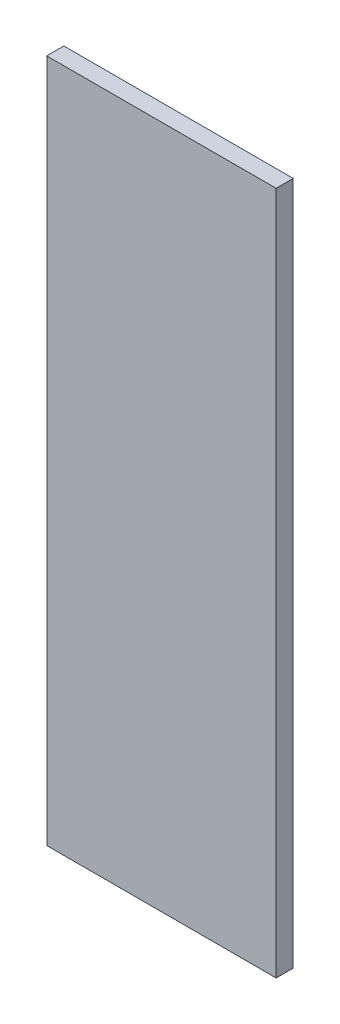
ISO-10303-21;
HEADER;
FILE_DESCRIPTION(('STEP AP214'),'2;1');
FILE_NAME('part.step','',(''),(''),'','','');
FILE_SCHEMA(('AUTOMOTIVE_DESIGN { 1 0 10303 214 1 1 1 1 }'));
ENDSEC;
DATA;
#1=APPLICATION_CONTEXT('core data for automotive mechanical design processes');
#2=APPLICATION_PROTOCOL_DEFINITION('international standard','automotive_design',2000,#1);
#3=PRODUCT_CONTEXT('',#1,'mechanical');
#4=PRODUCT('Part','Part','',(#3));
#5=PRODUCT_RELATED_PRODUCT_CATEGORY('part','',(#4));
#6=PRODUCT_DEFINITION_FORMATION('','',#4);
#7=PRODUCT_DEFINITION_CONTEXT('part definition',#1,'design');
#8=PRODUCT_DEFINITION('design','',#6,#7);
#9=PRODUCT_DEFINITION_SHAPE('','',#8);
#10=(LENGTH_UNIT() NAMED_UNIT(*) SI_UNIT(.MILLI.,.METRE.));
#11=(NAMED_UNIT(*) PLANE_ANGLE_UNIT() SI_UNIT($,.RADIAN.));
#12=(NAMED_UNIT(*) SI_UNIT($,.STERADIAN.) SOLID_ANGLE_UNIT());
#13=UNCERTAINTY_MEASURE_WITH_UNIT(LENGTH_MEASURE(1.E-05),#10,'distance_accuracy_value','');
#14=(GEOMETRIC_REPRESENTATION_CONTEXT(3) GLOBAL_UNCERTAINTY_ASSIGNED_CONTEXT((#13)) GLOBAL_UNIT_ASSIGNED_CONTEXT((#10,
#11,#12)) REPRESENTATION_CONTEXT('',''));
#15=CARTESIAN_POINT('',(0.,0.,0.));
#16=DIRECTION('',(0.,0.,1.));
#17=DIRECTION('',(1.,0.,0.));
#18=AXIS2_PLACEMENT_3D('',#15,#16,#17);
#19=CARTESIAN_POINT('',(21.298547485,-63.5,3.175));
#20=DIRECTION('',(-1.,0.,0.));
#21=DIRECTION('',(0.,0.,1.));
#22=AXIS2_PLACEMENT_3D('',#19,#20,#21);
#23=PLANE('',#22);
#24=DIRECTION('',(0.,1.,0.));
#25=VECTOR('',#24,1.);
#26=CARTESIAN_POINT('',(21.298547485,-63.5,0.));
#27=LINE('',#26,#25);
#28=CARTESIAN_POINT('',(21.298547485,-63.5,0.));
#29=VERTEX_POINT('',#28);
#30=CARTESIAN_POINT('',(21.298547485,63.5,0.));
#31=VERTEX_POINT('',#30);
#32=EDGE_CURVE('E107',#29,#31,#27,.T.);
#33=ORIENTED_EDGE('',*,*,#32,.T.);
#34=DIRECTION('',(0.,0.,-1.));
#35=VECTOR('',#34,1.);
#36=CARTESIAN_POINT('',(21.298547485,63.5,3.175));
#37=LINE('',#36,#35);
#38=CARTESIAN_POINT('',(21.298547485,63.5,3.175));
#39=VERTEX_POINT('',#38);
#40=EDGE_CURVE('E11',#39,#31,#37,.T.);
#41=ORIENTED_EDGE('',*,*,#40,.F.);
#42=DIRECTION('',(0.,1.,0.));
#43=VECTOR('',#42,1.);
#44=CARTESIAN_POINT('',(21.298547485,-63.5,3.175));
#45=LINE('',#44,#43);
#46=CARTESIAN_POINT('',(21.298547485,-63.5,3.175));
#47=VERTEX_POINT('',#46);
#48=EDGE_CURVE('E91',#47,#39,#45,.T.);
#49=ORIENTED_EDGE('',*,*,#48,.F.);
#50=DIRECTION('',(0.,0.,-1.));
#51=VECTOR('',#50,1.);
#52=CARTESIAN_POINT('',(21.298547485,-63.5,3.175));
#53=LINE('',#52,#51);
#54=EDGE_CURVE('E103',#47,#29,#53,.T.);
#55=ORIENTED_EDGE('',*,*,#54,.T.);
#56=EDGE_LOOP('',(#33,#41,#49,#55));
#57=FACE_BOUND('',#56,.T.);
#58=ADVANCED_FACE('F39',(#57),#23,.F.);
#59=CARTESIAN_POINT('',(-21.298547485,63.5,3.175));
#60=DIRECTION('',(0.,-1.,0.));
#61=DIRECTION('',(0.,0.,-1.));
#62=AXIS2_PLACEMENT_3D('',#59,#60,#61);
#63=PLANE('',#62);
#64=DIRECTION('',(-1.,0.,0.));
#65=VECTOR('',#64,1.);
#66=CARTESIAN_POINT('',(-21.298547485,63.5,0.));
#67=LINE('',#66,#65);
#68=CARTESIAN_POINT('',(-21.298547485,63.5,0.));
#69=VERTEX_POINT('',#68);
#70=EDGE_CURVE('E96',#31,#69,#67,.T.);
#71=ORIENTED_EDGE('',*,*,#70,.T.);
#72=DIRECTION('',(0.,0.,-1.));
#73=VECTOR('',#72,1.);
#74=CARTESIAN_POINT('',(-21.298547485,63.5,3.175));
#75=LINE('',#74,#73);
#76=CARTESIAN_POINT('',(-21.298547485,63.5,3.175));
#77=VERTEX_POINT('',#76);
#78=EDGE_CURVE('E48',#77,#69,#75,.T.);
#79=ORIENTED_EDGE('',*,*,#78,.F.);
#80=DIRECTION('',(-1.,0.,0.));
#81=VECTOR('',#80,1.);
#82=CARTESIAN_POINT('',(-21.298547485,63.5,3.175));
#83=LINE('',#82,#81);
#84=EDGE_CURVE('E86',#39,#77,#83,.T.);
#85=ORIENTED_EDGE('',*,*,#84,.F.);
#86=ORIENTED_EDGE('',*,*,#40,.T.);
#87=EDGE_LOOP('',(#71,#79,#85,#86));
#88=FACE_BOUND('',#87,.T.);
#89=ADVANCED_FACE('F95',(#88),#63,.F.);
#90=CARTESIAN_POINT('',(-21.298547485,-63.5,3.175));
#91=DIRECTION('',(1.,0.,0.));
#92=DIRECTION('',(0.,0.,-1.));
#93=AXIS2_PLACEMENT_3D('',#90,#91,#92);
#94=PLANE('',#93);
#95=DIRECTION('',(0.,-1.,0.));
#96=VECTOR('',#95,1.);
#97=CARTESIAN_POINT('',(-21.298547485,-63.5,0.));
#98=LINE('',#97,#96);
#99=CARTESIAN_POINT('',(-21.298547485,-63.5,0.));
#100=VERTEX_POINT('',#99);
#101=EDGE_CURVE('E73',#69,#100,#98,.T.);
#102=ORIENTED_EDGE('',*,*,#101,.T.);
#103=DIRECTION('',(0.,0.,-1.));
#104=VECTOR('',#103,1.);
#105=CARTESIAN_POINT('',(-21.298547485,-63.5,3.175));
#106=LINE('',#105,#104);
#107=CARTESIAN_POINT('',(-21.298547485,-63.5,3.175));
#108=VERTEX_POINT('',#107);
#109=EDGE_CURVE('E98',#108,#100,#106,.T.);
#110=ORIENTED_EDGE('',*,*,#109,.F.);
#111=DIRECTION('',(0.,-1.,0.));
#112=VECTOR('',#111,1.);
#113=CARTESIAN_POINT('',(-21.298547485,-63.5,3.175));
#114=LINE('',#113,#112);
#115=EDGE_CURVE('E89',#77,#108,#114,.T.);
#116=ORIENTED_EDGE('',*,*,#115,.F.);
#117=ORIENTED_EDGE('',*,*,#78,.T.);
#118=EDGE_LOOP('',(#102,#110,#116,#117));
#119=FACE_BOUND('',#118,.T.);
#120=ADVANCED_FACE('F99',(#119),#94,.F.);
#121=CARTESIAN_POINT('',(-21.298547485,-63.5,3.175));
#122=DIRECTION('',(0.,1.,0.));
#123=DIRECTION('',(0.,0.,1.));
#124=AXIS2_PLACEMENT_3D('',#121,#122,#123);
#125=PLANE('',#124);
#126=DIRECTION('',(1.,0.,0.));
#127=VECTOR('',#126,1.);
#128=CARTESIAN_POINT('',(-21.298547485,-63.5,0.));
#129=LINE('',#128,#127);
#130=EDGE_CURVE('E79',#100,#29,#129,.T.);
#131=ORIENTED_EDGE('',*,*,#130,.T.);
#132=ORIENTED_EDGE('',*,*,#54,.F.);
#133=DIRECTION('',(1.,0.,0.));
#134=VECTOR('',#133,1.);
#135=CARTESIAN_POINT('',(-21.298547485,-63.5,3.175));
#136=LINE('',#135,#134);
#137=EDGE_CURVE('E56',#108,#47,#136,.T.);
#138=ORIENTED_EDGE('',*,*,#137,.F.);
#139=ORIENTED_EDGE('',*,*,#109,.T.);
#140=EDGE_LOOP('',(#131,#132,#138,#139));
#141=FACE_BOUND('',#140,.T.);
#142=ADVANCED_FACE('F120',(#141),#125,.F.);
#143=CARTESIAN_POINT('',(0.,0.,3.175));
#144=DIRECTION('',(0.,0.,-1.));
#145=DIRECTION('',(-1.,0.,0.));
#146=AXIS2_PLACEMENT_3D('',#143,#144,#145);
#147=PLANE('',#146);
#148=ORIENTED_EDGE('',*,*,#48,.T.);
#149=ORIENTED_EDGE('',*,*,#84,.T.);
#150=ORIENTED_EDGE('',*,*,#115,.T.);
#151=ORIENTED_EDGE('',*,*,#137,.T.);
#152=EDGE_LOOP('',(#148,#149,#150,#151));
#153=FACE_BOUND('',#152,.T.);
#154=ADVANCED_FACE('F87',(#153),#147,.F.);
#155=CARTESIAN_POINT('',(0.,0.,0.));
#156=DIRECTION('',(0.,0.,-1.));
#157=DIRECTION('',(-1.,0.,0.));
#158=AXIS2_PLACEMENT_3D('',#155,#156,#157);
#159=PLANE('',#158);
#160=ORIENTED_EDGE('',*,*,#32,.F.);
#161=ORIENTED_EDGE('',*,*,#130,.F.);
#162=ORIENTED_EDGE('',*,*,#101,.F.);
#163=ORIENTED_EDGE('',*,*,#70,.F.);
#164=EDGE_LOOP('',(#160,#161,#162,#163));
#165=FACE_BOUND('',#164,.T.);
#166=ADVANCED_FACE('F123',(#165),#159,.T.);
#167=CLOSED_SHELL('',(#58,#89,#120,#142,#154,#166));
#168=MANIFOLD_SOLID_BREP('B2',#167);
#169=ADVANCED_BREP_SHAPE_REPRESENTATION('',(#18,#168),#14);
#170=SHAPE_DEFINITION_REPRESENTATION(#9,#169);
ENDSEC;
END-ISO-10303-21;
